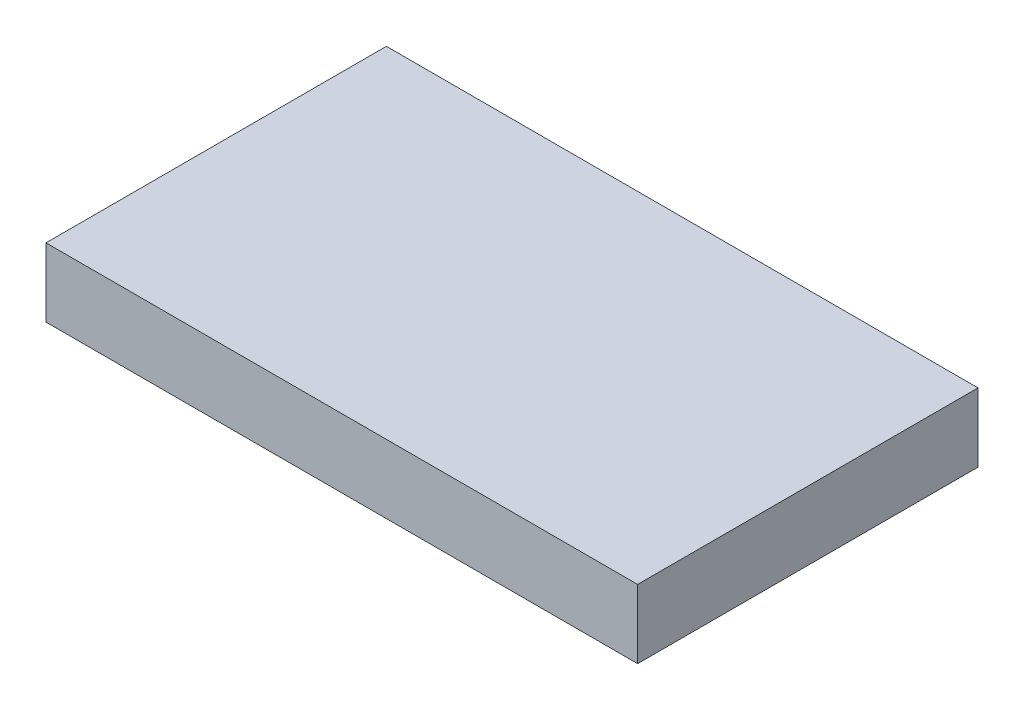
ISO-10303-21;
HEADER;
FILE_DESCRIPTION(('STEP AP214'),'2;1');
FILE_NAME('part.step','',(''),(''),'','','');
FILE_SCHEMA(('AUTOMOTIVE_DESIGN { 1 0 10303 214 1 1 1 1 }'));
ENDSEC;
DATA;
#1=APPLICATION_CONTEXT('core data for automotive mechanical design processes');
#2=APPLICATION_PROTOCOL_DEFINITION('international standard','automotive_design',2000,#1);
#3=PRODUCT_CONTEXT('',#1,'mechanical');
#4=PRODUCT('Part','Part','',(#3));
#5=PRODUCT_RELATED_PRODUCT_CATEGORY('part','',(#4));
#6=PRODUCT_DEFINITION_FORMATION('','',#4);
#7=PRODUCT_DEFINITION_CONTEXT('part definition',#1,'design');
#8=PRODUCT_DEFINITION('design','',#6,#7);
#9=PRODUCT_DEFINITION_SHAPE('','',#8);
#10=(LENGTH_UNIT() NAMED_UNIT(*) SI_UNIT(.MILLI.,.METRE.));
#11=(NAMED_UNIT(*) PLANE_ANGLE_UNIT() SI_UNIT($,.RADIAN.));
#12=(NAMED_UNIT(*) SI_UNIT($,.STERADIAN.) SOLID_ANGLE_UNIT());
#13=UNCERTAINTY_MEASURE_WITH_UNIT(LENGTH_MEASURE(1.E-05),#10,'distance_accuracy_value','');
#14=(GEOMETRIC_REPRESENTATION_CONTEXT(3) GLOBAL_UNCERTAINTY_ASSIGNED_CONTEXT((#13)) GLOBAL_UNIT_ASSIGNED_CONTEXT((#10,
#11,#12)) REPRESENTATION_CONTEXT('',''));
#15=CARTESIAN_POINT('',(0.,0.,0.));
#16=DIRECTION('',(0.,0.,1.));
#17=DIRECTION('',(1.,0.,0.));
#18=AXIS2_PLACEMENT_3D('',#15,#16,#17);
#19=CARTESIAN_POINT('',(-49.5793760842666,10.,-42.2605158051605));
#20=DIRECTION('',(1.,0.,0.));
#21=DIRECTION('',(0.,0.,-1.));
#22=AXIS2_PLACEMENT_3D('',#19,#20,#21);
#23=PLANE('',#22);
#24=DIRECTION('',(0.,0.,1.));
#25=VECTOR('',#24,1.);
#26=CARTESIAN_POINT('',(-49.5793760842666,0.,-42.2605158051605));
#27=LINE('',#26,#25);
#28=CARTESIAN_POINT('',(-49.5793760842666,0.,-42.2605158051605));
#29=VERTEX_POINT('',#28);
#30=CARTESIAN_POINT('',(-49.5793760842666,0.,7.31886027910601));
#31=VERTEX_POINT('',#30);
#32=EDGE_CURVE('E102',#29,#31,#27,.T.);
#33=ORIENTED_EDGE('',*,*,#32,.T.);
#34=DIRECTION('',(0.,-1.,0.));
#35=VECTOR('',#34,1.);
#36=CARTESIAN_POINT('',(-49.5793760842666,10.,7.31886027910601));
#37=LINE('',#36,#35);
#38=CARTESIAN_POINT('',(-49.5793760842666,10.,7.31886027910601));
#39=VERTEX_POINT('',#38);
#40=EDGE_CURVE('E11',#39,#31,#37,.T.);
#41=ORIENTED_EDGE('',*,*,#40,.F.);
#42=DIRECTION('',(0.,0.,1.));
#43=VECTOR('',#42,1.);
#44=CARTESIAN_POINT('',(-49.5793760842666,10.,-42.2605158051605));
#45=LINE('',#44,#43);
#46=CARTESIAN_POINT('',(-49.5793760842666,10.,-42.2605158051605));
#47=VERTEX_POINT('',#46);
#48=EDGE_CURVE('E90',#47,#39,#45,.T.);
#49=ORIENTED_EDGE('',*,*,#48,.F.);
#50=DIRECTION('',(0.,-1.,0.));
#51=VECTOR('',#50,1.);
#52=CARTESIAN_POINT('',(-49.5793760842666,10.,-42.2605158051605));
#53=LINE('',#52,#51);
#54=EDGE_CURVE('E98',#47,#29,#53,.T.);
#55=ORIENTED_EDGE('',*,*,#54,.T.);
#56=EDGE_LOOP('',(#33,#41,#49,#55));
#57=FACE_BOUND('',#56,.T.);
#58=ADVANCED_FACE('F39',(#57),#23,.F.);
#59=CARTESIAN_POINT('',(-49.5793760842666,10.,7.31886027910601));
#60=DIRECTION('',(0.,0.,-1.));
#61=DIRECTION('',(-1.,0.,0.));
#62=AXIS2_PLACEMENT_3D('',#59,#60,#61);
#63=PLANE('',#62);
#64=DIRECTION('',(1.,0.,0.));
#65=VECTOR('',#64,1.);
#66=CARTESIAN_POINT('',(-49.5793760842666,0.,7.31886027910601));
#67=LINE('',#66,#65);
#68=CARTESIAN_POINT('',(36.59430139553,0.,7.31886027910601));
#69=VERTEX_POINT('',#68);
#70=EDGE_CURVE('E94',#31,#69,#67,.T.);
#71=ORIENTED_EDGE('',*,*,#70,.T.);
#72=DIRECTION('',(0.,-1.,0.));
#73=VECTOR('',#72,1.);
#74=CARTESIAN_POINT('',(36.59430139553,10.,7.31886027910601));
#75=LINE('',#74,#73);
#76=CARTESIAN_POINT('',(36.59430139553,10.,7.31886027910601));
#77=VERTEX_POINT('',#76);
#78=EDGE_CURVE('E47',#77,#69,#75,.T.);
#79=ORIENTED_EDGE('',*,*,#78,.F.);
#80=DIRECTION('',(1.,0.,0.));
#81=VECTOR('',#80,1.);
#82=CARTESIAN_POINT('',(-49.5793760842666,10.,7.31886027910601));
#83=LINE('',#82,#81);
#84=EDGE_CURVE('E85',#39,#77,#83,.T.);
#85=ORIENTED_EDGE('',*,*,#84,.F.);
#86=ORIENTED_EDGE('',*,*,#40,.T.);
#87=EDGE_LOOP('',(#71,#79,#85,#86));
#88=FACE_BOUND('',#87,.T.);
#89=ADVANCED_FACE('F93',(#88),#63,.F.);
#90=CARTESIAN_POINT('',(36.59430139553,10.,-42.2605158051605));
#91=DIRECTION('',(-1.,0.,0.));
#92=DIRECTION('',(0.,0.,1.));
#93=AXIS2_PLACEMENT_3D('',#90,#91,#92);
#94=PLANE('',#93);
#95=DIRECTION('',(0.,0.,-1.));
#96=VECTOR('',#95,1.);
#97=CARTESIAN_POINT('',(36.59430139553,0.,-42.2605158051605));
#98=LINE('',#97,#96);
#99=CARTESIAN_POINT('',(36.59430139553,0.,-42.2605158051605));
#100=VERTEX_POINT('',#99);
#101=EDGE_CURVE('E72',#69,#100,#98,.T.);
#102=ORIENTED_EDGE('',*,*,#101,.T.);
#103=DIRECTION('',(0.,-1.,0.));
#104=VECTOR('',#103,1.);
#105=CARTESIAN_POINT('',(36.59430139553,10.,-42.2605158051605));
#106=LINE('',#105,#104);
#107=CARTESIAN_POINT('',(36.59430139553,10.,-42.2605158051605));
#108=VERTEX_POINT('',#107);
#109=EDGE_CURVE('E95',#108,#100,#106,.T.);
#110=ORIENTED_EDGE('',*,*,#109,.F.);
#111=DIRECTION('',(0.,0.,-1.));
#112=VECTOR('',#111,1.);
#113=CARTESIAN_POINT('',(36.59430139553,10.,-42.2605158051605));
#114=LINE('',#113,#112);
#115=EDGE_CURVE('E88',#77,#108,#114,.T.);
#116=ORIENTED_EDGE('',*,*,#115,.F.);
#117=ORIENTED_EDGE('',*,*,#78,.T.);
#118=EDGE_LOOP('',(#102,#110,#116,#117));
#119=FACE_BOUND('',#118,.T.);
#120=ADVANCED_FACE('F96',(#119),#94,.F.);
#121=CARTESIAN_POINT('',(-49.5793760842666,10.,-42.2605158051605));
#122=DIRECTION('',(0.,0.,1.));
#123=DIRECTION('',(1.,0.,0.));
#124=AXIS2_PLACEMENT_3D('',#121,#122,#123);
#125=PLANE('',#124);
#126=DIRECTION('',(-1.,0.,0.));
#127=VECTOR('',#126,1.);
#128=CARTESIAN_POINT('',(-49.5793760842666,0.,-42.2605158051605));
#129=LINE('',#128,#127);
#130=EDGE_CURVE('E78',#100,#29,#129,.T.);
#131=ORIENTED_EDGE('',*,*,#130,.T.);
#132=ORIENTED_EDGE('',*,*,#54,.F.);
#133=DIRECTION('',(-1.,0.,0.));
#134=VECTOR('',#133,1.);
#135=CARTESIAN_POINT('',(-49.5793760842666,10.,-42.2605158051605));
#136=LINE('',#135,#134);
#137=EDGE_CURVE('E55',#108,#47,#136,.T.);
#138=ORIENTED_EDGE('',*,*,#137,.F.);
#139=ORIENTED_EDGE('',*,*,#109,.T.);
#140=EDGE_LOOP('',(#131,#132,#138,#139));
#141=FACE_BOUND('',#140,.T.);
#142=ADVANCED_FACE('F109',(#141),#125,.F.);
#143=CARTESIAN_POINT('',(0.,10.,0.));
#144=DIRECTION('',(0.,1.,0.));
#145=DIRECTION('',(0.,0.,1.));
#146=AXIS2_PLACEMENT_3D('',#143,#144,#145);
#147=PLANE('',#146);
#148=ORIENTED_EDGE('',*,*,#48,.T.);
#149=ORIENTED_EDGE('',*,*,#84,.T.);
#150=ORIENTED_EDGE('',*,*,#115,.T.);
#151=ORIENTED_EDGE('',*,*,#137,.T.);
#152=EDGE_LOOP('',(#148,#149,#150,#151));
#153=FACE_BOUND('',#152,.T.);
#154=ADVANCED_FACE('F86',(#153),#147,.T.);
#155=CARTESIAN_POINT('',(0.,0.,0.));
#156=DIRECTION('',(0.,1.,0.));
#157=DIRECTION('',(0.,0.,1.));
#158=AXIS2_PLACEMENT_3D('',#155,#156,#157);
#159=PLANE('',#158);
#160=ORIENTED_EDGE('',*,*,#32,.F.);
#161=ORIENTED_EDGE('',*,*,#130,.F.);
#162=ORIENTED_EDGE('',*,*,#101,.F.);
#163=ORIENTED_EDGE('',*,*,#70,.F.);
#164=EDGE_LOOP('',(#160,#161,#162,#163));
#165=FACE_BOUND('',#164,.T.);
#166=ADVANCED_FACE('F112',(#165),#159,.F.);
#167=CLOSED_SHELL('',(#58,#89,#120,#142,#154,#166));
#168=MANIFOLD_SOLID_BREP('B2',#167);
#169=ADVANCED_BREP_SHAPE_REPRESENTATION('',(#18,#168),#14);
#170=SHAPE_DEFINITION_REPRESENTATION(#9,#169);
ENDSEC;
END-ISO-10303-21;
